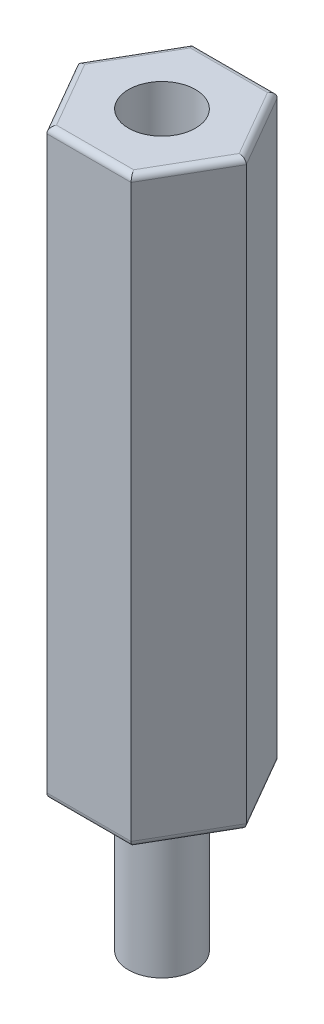
ISO-10303-21;
HEADER;
FILE_DESCRIPTION(('STEP AP214'),'2;1');
FILE_NAME('part.step','',(''),(''),'','','');
FILE_SCHEMA(('AUTOMOTIVE_DESIGN { 1 0 10303 214 1 1 1 1 }'));
ENDSEC;
DATA;
#1=APPLICATION_CONTEXT('core data for automotive mechanical design processes');
#2=APPLICATION_PROTOCOL_DEFINITION('international standard','automotive_design',2000,#1);
#3=PRODUCT_CONTEXT('',#1,'mechanical');
#4=PRODUCT('Part','Part','',(#3));
#5=PRODUCT_RELATED_PRODUCT_CATEGORY('part','',(#4));
#6=PRODUCT_DEFINITION_FORMATION('','',#4);
#7=PRODUCT_DEFINITION_CONTEXT('part definition',#1,'design');
#8=PRODUCT_DEFINITION('design','',#6,#7);
#9=PRODUCT_DEFINITION_SHAPE('','',#8);
#10=(LENGTH_UNIT() NAMED_UNIT(*) SI_UNIT(.MILLI.,.METRE.));
#11=(NAMED_UNIT(*) PLANE_ANGLE_UNIT() SI_UNIT($,.RADIAN.));
#12=(NAMED_UNIT(*) SI_UNIT($,.STERADIAN.) SOLID_ANGLE_UNIT());
#13=UNCERTAINTY_MEASURE_WITH_UNIT(LENGTH_MEASURE(1.E-05),#10,'distance_accuracy_value','');
#14=(GEOMETRIC_REPRESENTATION_CONTEXT(3) GLOBAL_UNCERTAINTY_ASSIGNED_CONTEXT((#13)) GLOBAL_UNIT_ASSIGNED_CONTEXT((#10,
#11,#12)) REPRESENTATION_CONTEXT('',''));
#15=CARTESIAN_POINT('',(0.,0.,0.));
#16=DIRECTION('',(0.,0.,1.));
#17=DIRECTION('',(1.,0.,0.));
#18=AXIS2_PLACEMENT_3D('',#15,#16,#17);
#19=CARTESIAN_POINT('',(2.74818728134262,0.,0.));
#20=DIRECTION('',(0.,1.,0.));
#21=DIRECTION('',(0.,0.,1.));
#22=AXIS2_PLACEMENT_3D('',#19,#20,#21);
#23=PLANE('',#22);
#24=DIRECTION('',(0.5,0.,-0.866025403784439));
#25=VECTOR('',#24,1.);
#26=CARTESIAN_POINT('',(2.57498220058573,0.,-0.1));
#27=LINE('',#26,#25);
#28=CARTESIAN_POINT('',(2.51724717366677,0.,0.));
#29=VERTEX_POINT('',#28);
#30=CARTESIAN_POINT('',(1.25862358683338,0.,2.18));
#31=VERTEX_POINT('',#30);
#32=EDGE_CURVE('E185',#29,#31,#27,.F.);
#33=ORIENTED_EDGE('',*,*,#32,.T.);
#34=DIRECTION('',(1.,0.,0.));
#35=VECTOR('',#34,1.);
#36=CARTESIAN_POINT('',(2.74818728134262,0.,2.18));
#37=LINE('',#36,#35);
#38=CARTESIAN_POINT('',(-1.25862358683339,0.,2.18));
#39=VERTEX_POINT('',#38);
#40=EDGE_CURVE('E38',#31,#39,#37,.F.);
#41=ORIENTED_EDGE('',*,*,#40,.T.);
#42=DIRECTION('',(0.5,0.,0.866025403784439));
#43=VECTOR('',#42,1.);
#44=CARTESIAN_POINT('',(-1.20088855991442,0.,2.28));
#45=LINE('',#44,#43);
#46=CARTESIAN_POINT('',(-2.51724717366677,0.,0.));
#47=VERTEX_POINT('',#46);
#48=EDGE_CURVE('E52',#39,#47,#45,.F.);
#49=ORIENTED_EDGE('',*,*,#48,.T.);
#50=DIRECTION('',(-0.5,0.,0.866025403784439));
#51=VECTOR('',#50,1.);
#52=CARTESIAN_POINT('',(-1.20088855991442,0.,-2.28));
#53=LINE('',#52,#51);
#54=CARTESIAN_POINT('',(-1.25862358683338,0.,-2.18));
#55=VERTEX_POINT('',#54);
#56=EDGE_CURVE('E191',#47,#55,#53,.F.);
#57=ORIENTED_EDGE('',*,*,#56,.T.);
#58=DIRECTION('',(-1.,0.,0.));
#59=VECTOR('',#58,1.);
#60=CARTESIAN_POINT('',(2.74818728134262,0.,-2.18));
#61=LINE('',#60,#59);
#62=CARTESIAN_POINT('',(1.25862358683338,0.,-2.18));
#63=VERTEX_POINT('',#62);
#64=EDGE_CURVE('E189',#55,#63,#61,.F.);
#65=ORIENTED_EDGE('',*,*,#64,.T.);
#66=DIRECTION('',(-0.5,0.,-0.866025403784439));
#67=VECTOR('',#66,1.);
#68=CARTESIAN_POINT('',(2.57498220058573,0.,0.1));
#69=LINE('',#68,#67);
#70=EDGE_CURVE('E187',#63,#29,#69,.F.);
#71=ORIENTED_EDGE('',*,*,#70,.T.);
#72=EDGE_LOOP('',(#33,#41,#49,#57,#65,#71));
#73=FACE_BOUND('',#72,.T.);
#74=CARTESIAN_POINT('',(0.,0.,0.));
#75=DIRECTION('',(0.,1.,0.));
#76=DIRECTION('',(0.,0.,1.));
#77=AXIS2_PLACEMENT_3D('',#74,#75,#76);
#78=CIRCLE('',#77,1.0922);
#79=CARTESIAN_POINT('',(0.,0.,1.0922));
#80=VERTEX_POINT('',#79);
#81=EDGE_CURVE('E11',#80,#80,#78,.F.);
#82=ORIENTED_EDGE('',*,*,#81,.F.);
#83=EDGE_LOOP('',(#82));
#84=FACE_BOUND('',#83,.T.);
#85=ADVANCED_FACE('F30',(#73,#84),#23,.F.);
#86=CARTESIAN_POINT('',(1.37409364067131,19.,2.38));
#87=DIRECTION('',(-0.866025403784439,0.,-0.5));
#88=DIRECTION('',(-0.5,0.,0.866025403784439));
#89=AXIS2_PLACEMENT_3D('',#86,#87,#88);
#90=PLANE('',#89);
#91=DIRECTION('',(0.,-1.,0.));
#92=VECTOR('',#91,1.);
#93=CARTESIAN_POINT('',(2.74818728134262,19.,0.));
#94=LINE('',#93,#92);
#95=CARTESIAN_POINT('',(2.74818728134262,18.8,0.));
#96=VERTEX_POINT('',#95);
#97=CARTESIAN_POINT('',(2.74818728134262,0.200000000000002,0.));
#98=VERTEX_POINT('',#97);
#99=EDGE_CURVE('E146',#96,#98,#94,.T.);
#100=ORIENTED_EDGE('',*,*,#99,.F.);
#101=DIRECTION('',(0.5,0.,-0.866025403784439));
#102=VECTOR('',#101,1.);
#103=CARTESIAN_POINT('',(1.37409364067131,18.8,2.38));
#104=LINE('',#103,#102);
#105=CARTESIAN_POINT('',(1.37409364067131,18.8,2.38));
#106=VERTEX_POINT('',#105);
#107=EDGE_CURVE('E137',#96,#106,#104,.F.);
#108=ORIENTED_EDGE('',*,*,#107,.T.);
#109=DIRECTION('',(0.,-1.,0.));
#110=VECTOR('',#109,1.);
#111=CARTESIAN_POINT('',(1.37409364067131,19.,2.38));
#112=LINE('',#111,#110);
#113=CARTESIAN_POINT('',(1.37409364067131,0.200000000000002,2.38));
#114=VERTEX_POINT('',#113);
#115=EDGE_CURVE('E205',#106,#114,#112,.T.);
#116=ORIENTED_EDGE('',*,*,#115,.T.);
#117=DIRECTION('',(0.5,0.,-0.866025403784439));
#118=VECTOR('',#117,1.);
#119=CARTESIAN_POINT('',(1.37409364067131,0.199999999999999,2.38));
#120=LINE('',#119,#118);
#121=EDGE_CURVE('E178',#114,#98,#120,.T.);
#122=ORIENTED_EDGE('',*,*,#121,.T.);
#123=EDGE_LOOP('',(#100,#108,#116,#122));
#124=FACE_BOUND('',#123,.T.);
#125=ADVANCED_FACE('F250',(#124),#90,.F.);
#126=CARTESIAN_POINT('',(2.74818728134262,19.,0.));
#127=DIRECTION('',(-0.866025403784439,0.,0.5));
#128=DIRECTION('',(0.5,0.,0.866025403784439));
#129=AXIS2_PLACEMENT_3D('',#126,#127,#128);
#130=PLANE('',#129);
#131=DIRECTION('',(0.,-1.,0.));
#132=VECTOR('',#131,1.);
#133=CARTESIAN_POINT('',(1.37409364067131,19.,-2.38));
#134=LINE('',#133,#132);
#135=CARTESIAN_POINT('',(1.37409364067131,18.8,-2.38));
#136=VERTEX_POINT('',#135);
#137=CARTESIAN_POINT('',(1.37409364067131,0.200000000000002,-2.38));
#138=VERTEX_POINT('',#137);
#139=EDGE_CURVE('E149',#136,#138,#134,.T.);
#140=ORIENTED_EDGE('',*,*,#139,.F.);
#141=DIRECTION('',(-0.5,0.,-0.866025403784439));
#142=VECTOR('',#141,1.);
#143=CARTESIAN_POINT('',(2.74818728134262,18.8,0.));
#144=LINE('',#143,#142);
#145=EDGE_CURVE('E183',#136,#96,#144,.F.);
#146=ORIENTED_EDGE('',*,*,#145,.T.);
#147=ORIENTED_EDGE('',*,*,#99,.T.);
#148=DIRECTION('',(-0.5,0.,-0.866025403784439));
#149=VECTOR('',#148,1.);
#150=CARTESIAN_POINT('',(2.74818728134262,0.199999999999999,0.));
#151=LINE('',#150,#149);
#152=EDGE_CURVE('E181',#98,#138,#151,.T.);
#153=ORIENTED_EDGE('',*,*,#152,.T.);
#154=EDGE_LOOP('',(#140,#146,#147,#153));
#155=FACE_BOUND('',#154,.T.);
#156=ADVANCED_FACE('F268',(#155),#130,.F.);
#157=CARTESIAN_POINT('',(1.37409364067131,19.,-2.38));
#158=DIRECTION('',(0.,0.,1.));
#159=DIRECTION('',(1.,0.,0.));
#160=AXIS2_PLACEMENT_3D('',#157,#158,#159);
#161=PLANE('',#160);
#162=DIRECTION('',(0.,-1.,0.));
#163=VECTOR('',#162,1.);
#164=CARTESIAN_POINT('',(-1.37409364067131,19.,-2.38));
#165=LINE('',#164,#163);
#166=CARTESIAN_POINT('',(-1.37409364067131,18.8,-2.38));
#167=VERTEX_POINT('',#166);
#168=CARTESIAN_POINT('',(-1.37409364067131,0.200000000000002,-2.38));
#169=VERTEX_POINT('',#168);
#170=EDGE_CURVE('E259',#167,#169,#165,.T.);
#171=ORIENTED_EDGE('',*,*,#170,.F.);
#172=DIRECTION('',(-1.,0.,0.));
#173=VECTOR('',#172,1.);
#174=CARTESIAN_POINT('',(1.37409364067131,18.8,-2.38));
#175=LINE('',#174,#173);
#176=EDGE_CURVE('E162',#167,#136,#175,.F.);
#177=ORIENTED_EDGE('',*,*,#176,.T.);
#178=ORIENTED_EDGE('',*,*,#139,.T.);
#179=DIRECTION('',(-1.,0.,0.));
#180=VECTOR('',#179,1.);
#181=CARTESIAN_POINT('',(1.37409364067131,0.199999999999999,-2.38));
#182=LINE('',#181,#180);
#183=EDGE_CURVE('E160',#138,#169,#182,.T.);
#184=ORIENTED_EDGE('',*,*,#183,.T.);
#185=EDGE_LOOP('',(#171,#177,#178,#184));
#186=FACE_BOUND('',#185,.T.);
#187=ADVANCED_FACE('F265',(#186),#161,.F.);
#188=CARTESIAN_POINT('',(-1.37409364067131,19.,-2.38));
#189=DIRECTION('',(0.866025403784439,0.,0.5));
#190=DIRECTION('',(0.5,0.,-0.866025403784439));
#191=AXIS2_PLACEMENT_3D('',#188,#189,#190);
#192=PLANE('',#191);
#193=DIRECTION('',(0.,-1.,0.));
#194=VECTOR('',#193,1.);
#195=CARTESIAN_POINT('',(-2.74818728134262,19.,0.));
#196=LINE('',#195,#194);
#197=CARTESIAN_POINT('',(-2.74818728134262,18.8,0.));
#198=VERTEX_POINT('',#197);
#199=CARTESIAN_POINT('',(-2.74818728134262,0.200000000000002,0.));
#200=VERTEX_POINT('',#199);
#201=EDGE_CURVE('E252',#198,#200,#196,.T.);
#202=ORIENTED_EDGE('',*,*,#201,.F.);
#203=DIRECTION('',(-0.5,0.,0.866025403784439));
#204=VECTOR('',#203,1.);
#205=CARTESIAN_POINT('',(-1.37409364067131,18.8,-2.38));
#206=LINE('',#205,#204);
#207=EDGE_CURVE('E167',#198,#167,#206,.F.);
#208=ORIENTED_EDGE('',*,*,#207,.T.);
#209=ORIENTED_EDGE('',*,*,#170,.T.);
#210=DIRECTION('',(-0.5,0.,0.866025403784439));
#211=VECTOR('',#210,1.);
#212=CARTESIAN_POINT('',(-1.37409364067131,0.199999999999999,-2.38));
#213=LINE('',#212,#211);
#214=EDGE_CURVE('E165',#169,#200,#213,.T.);
#215=ORIENTED_EDGE('',*,*,#214,.T.);
#216=EDGE_LOOP('',(#202,#208,#209,#215));
#217=FACE_BOUND('',#216,.T.);
#218=ADVANCED_FACE('F275',(#217),#192,.F.);
#219=CARTESIAN_POINT('',(-2.74818728134262,19.,0.));
#220=DIRECTION('',(0.866025403784439,0.,-0.5));
#221=DIRECTION('',(-0.5,0.,-0.866025403784439));
#222=AXIS2_PLACEMENT_3D('',#219,#220,#221);
#223=PLANE('',#222);
#224=DIRECTION('',(0.,-1.,0.));
#225=VECTOR('',#224,1.);
#226=CARTESIAN_POINT('',(-1.37409364067131,19.,2.38));
#227=LINE('',#226,#225);
#228=CARTESIAN_POINT('',(-1.37409364067131,18.8,2.38));
#229=VERTEX_POINT('',#228);
#230=CARTESIAN_POINT('',(-1.37409364067131,0.200000000000002,2.38));
#231=VERTEX_POINT('',#230);
#232=EDGE_CURVE('E247',#229,#231,#227,.T.);
#233=ORIENTED_EDGE('',*,*,#232,.F.);
#234=DIRECTION('',(0.5,0.,0.866025403784439));
#235=VECTOR('',#234,1.);
#236=CARTESIAN_POINT('',(-2.74818728134262,18.8,0.));
#237=LINE('',#236,#235);
#238=EDGE_CURVE('E171',#229,#198,#237,.F.);
#239=ORIENTED_EDGE('',*,*,#238,.T.);
#240=ORIENTED_EDGE('',*,*,#201,.T.);
#241=DIRECTION('',(0.5,0.,0.866025403784439));
#242=VECTOR('',#241,1.);
#243=CARTESIAN_POINT('',(-2.74818728134262,0.199999999999999,0.));
#244=LINE('',#243,#242);
#245=EDGE_CURVE('E169',#200,#231,#244,.T.);
#246=ORIENTED_EDGE('',*,*,#245,.T.);
#247=EDGE_LOOP('',(#233,#239,#240,#246));
#248=FACE_BOUND('',#247,.T.);
#249=ADVANCED_FACE('F287',(#248),#223,.F.);
#250=CARTESIAN_POINT('',(-1.37409364067131,19.,2.38));
#251=DIRECTION('',(0.,0.,-1.));
#252=DIRECTION('',(-1.,0.,0.));
#253=AXIS2_PLACEMENT_3D('',#250,#251,#252);
#254=PLANE('',#253);
#255=ORIENTED_EDGE('',*,*,#115,.F.);
#256=DIRECTION('',(1.,0.,0.));
#257=VECTOR('',#256,1.);
#258=CARTESIAN_POINT('',(-1.37409364067131,18.8,2.38));
#259=LINE('',#258,#257);
#260=EDGE_CURVE('E176',#106,#229,#259,.F.);
#261=ORIENTED_EDGE('',*,*,#260,.T.);
#262=ORIENTED_EDGE('',*,*,#232,.T.);
#263=DIRECTION('',(1.,0.,0.));
#264=VECTOR('',#263,1.);
#265=CARTESIAN_POINT('',(-1.37409364067131,0.199999999999999,2.38));
#266=LINE('',#265,#264);
#267=EDGE_CURVE('E173',#231,#114,#266,.T.);
#268=ORIENTED_EDGE('',*,*,#267,.T.);
#269=EDGE_LOOP('',(#255,#261,#262,#268));
#270=FACE_BOUND('',#269,.T.);
#271=ADVANCED_FACE('F244',(#270),#254,.F.);
#272=CARTESIAN_POINT('',(2.74818728134262,19.,0.));
#273=DIRECTION('',(0.,1.,0.));
#274=DIRECTION('',(0.,0.,1.));
#275=AXIS2_PLACEMENT_3D('',#272,#273,#274);
#276=PLANE('',#275);
#277=CARTESIAN_POINT('',(0.,19.,0.));
#278=DIRECTION('',(0.,1.,0.));
#279=DIRECTION('',(0.,0.,1.));
#280=AXIS2_PLACEMENT_3D('',#277,#278,#279);
#281=CIRCLE('',#280,1.0922);
#282=CARTESIAN_POINT('',(0.,19.,1.0922));
#283=VERTEX_POINT('',#282);
#284=EDGE_CURVE('E370',#283,#283,#281,.T.);
#285=ORIENTED_EDGE('',*,*,#284,.F.);
#286=EDGE_LOOP('',(#285));
#287=FACE_BOUND('',#286,.T.);
#288=DIRECTION('',(-0.5,0.,-0.866025403784439));
#289=VECTOR('',#288,1.);
#290=CARTESIAN_POINT('',(1.20088855991442,19.,-2.28));
#291=LINE('',#290,#289);
#292=CARTESIAN_POINT('',(2.51724717366677,19.,0.));
#293=VERTEX_POINT('',#292);
#294=CARTESIAN_POINT('',(1.25862358683338,19.,-2.18));
#295=VERTEX_POINT('',#294);
#296=EDGE_CURVE('E125',#293,#295,#291,.T.);
#297=ORIENTED_EDGE('',*,*,#296,.T.);
#298=DIRECTION('',(-1.,0.,0.));
#299=VECTOR('',#298,1.);
#300=CARTESIAN_POINT('',(-1.37409364067131,19.,-2.18));
#301=LINE('',#300,#299);
#302=CARTESIAN_POINT('',(-1.25862358683338,19.,-2.18));
#303=VERTEX_POINT('',#302);
#304=EDGE_CURVE('E158',#295,#303,#301,.T.);
#305=ORIENTED_EDGE('',*,*,#304,.T.);
#306=DIRECTION('',(-0.5,0.,0.866025403784439));
#307=VECTOR('',#306,1.);
#308=CARTESIAN_POINT('',(-2.57498220058573,19.,0.100000000000001));
#309=LINE('',#308,#307);
#310=CARTESIAN_POINT('',(-2.51724717366677,19.,0.));
#311=VERTEX_POINT('',#310);
#312=EDGE_CURVE('E156',#303,#311,#309,.T.);
#313=ORIENTED_EDGE('',*,*,#312,.T.);
#314=DIRECTION('',(0.5,0.,0.866025403784439));
#315=VECTOR('',#314,1.);
#316=CARTESIAN_POINT('',(-1.20088855991442,19.,2.28));
#317=LINE('',#316,#315);
#318=CARTESIAN_POINT('',(-1.25862358683339,19.,2.18));
#319=VERTEX_POINT('',#318);
#320=EDGE_CURVE('E154',#311,#319,#317,.T.);
#321=ORIENTED_EDGE('',*,*,#320,.T.);
#322=DIRECTION('',(1.,0.,0.));
#323=VECTOR('',#322,1.);
#324=CARTESIAN_POINT('',(1.37409364067131,19.,2.18));
#325=LINE('',#324,#323);
#326=CARTESIAN_POINT('',(1.25862358683338,19.,2.18));
#327=VERTEX_POINT('',#326);
#328=EDGE_CURVE('E128',#319,#327,#325,.T.);
#329=ORIENTED_EDGE('',*,*,#328,.T.);
#330=DIRECTION('',(0.5,0.,-0.866025403784439));
#331=VECTOR('',#330,1.);
#332=CARTESIAN_POINT('',(2.57498220058573,19.,-0.1));
#333=LINE('',#332,#331);
#334=EDGE_CURVE('E120',#327,#293,#333,.T.);
#335=ORIENTED_EDGE('',*,*,#334,.T.);
#336=EDGE_LOOP('',(#297,#305,#313,#321,#329,#335));
#337=FACE_BOUND('',#336,.T.);
#338=ADVANCED_FACE('F122',(#287,#337),#276,.T.);
#339=CARTESIAN_POINT('',(2.74818728134262,18.8,2.18));
#340=DIRECTION('',(-1.,0.,0.));
#341=DIRECTION('',(0.,0.,1.));
#342=AXIS2_PLACEMENT_3D('',#339,#340,#341);
#343=CYLINDRICAL_SURFACE('',#342,0.2);
#344=CARTESIAN_POINT('',(-1.25862358683339,18.8,2.18));
#345=DIRECTION('',(-0.866025403784439,0.,-0.5));
#346=DIRECTION('',(-0.5,0.,0.866025403784439));
#347=AXIS2_PLACEMENT_3D('',#344,#345,#346);
#348=ELLIPSE('',#347,0.23094010767585,0.2);
#349=EDGE_CURVE('E140',#229,#319,#348,.T.);
#350=ORIENTED_EDGE('',*,*,#349,.F.);
#351=ORIENTED_EDGE('',*,*,#260,.F.);
#352=CARTESIAN_POINT('',(1.25862358683338,18.8,2.18));
#353=DIRECTION('',(-0.866025403784438,0.,0.5));
#354=DIRECTION('',(0.5,0.,0.866025403784439));
#355=AXIS2_PLACEMENT_3D('',#352,#353,#354);
#356=ELLIPSE('',#355,0.23094010767585,0.2);
#357=EDGE_CURVE('E203',#327,#106,#356,.F.);
#358=ORIENTED_EDGE('',*,*,#357,.F.);
#359=ORIENTED_EDGE('',*,*,#328,.F.);
#360=EDGE_LOOP('',(#350,#351,#358,#359));
#361=FACE_BOUND('',#360,.T.);
#362=ADVANCED_FACE('F310',(#361),#343,.T.);
#363=CARTESIAN_POINT('',(2.57498220058573,18.8,-0.1));
#364=DIRECTION('',(-0.5,0.,0.866025403784439));
#365=DIRECTION('',(0.866025403784439,0.,0.5));
#366=AXIS2_PLACEMENT_3D('',#363,#364,#365);
#367=CYLINDRICAL_SURFACE('',#366,0.2);
#368=ORIENTED_EDGE('',*,*,#357,.T.);
#369=ORIENTED_EDGE('',*,*,#107,.F.);
#370=CARTESIAN_POINT('',(2.51724717366677,18.8,0.));
#371=DIRECTION('',(0.,0.,1.));
#372=DIRECTION('',(1.,0.,0.));
#373=AXIS2_PLACEMENT_3D('',#370,#371,#372);
#374=ELLIPSE('',#373,0.23094010767585,0.2);
#375=EDGE_CURVE('E135',#293,#96,#374,.F.);
#376=ORIENTED_EDGE('',*,*,#375,.F.);
#377=ORIENTED_EDGE('',*,*,#334,.F.);
#378=EDGE_LOOP('',(#368,#369,#376,#377));
#379=FACE_BOUND('',#378,.T.);
#380=ADVANCED_FACE('F136',(#379),#367,.T.);
#381=CARTESIAN_POINT('',(-1.20088855991442,18.8,2.28));
#382=DIRECTION('',(-0.5,0.,-0.866025403784439));
#383=DIRECTION('',(-0.866025403784439,0.,0.5));
#384=AXIS2_PLACEMENT_3D('',#381,#382,#383);
#385=CYLINDRICAL_SURFACE('',#384,0.2);
#386=ORIENTED_EDGE('',*,*,#349,.T.);
#387=ORIENTED_EDGE('',*,*,#320,.F.);
#388=CARTESIAN_POINT('',(-2.51724717366677,18.8,0.));
#389=DIRECTION('',(0.,0.,-1.));
#390=DIRECTION('',(-1.,0.,0.));
#391=AXIS2_PLACEMENT_3D('',#388,#389,#390);
#392=ELLIPSE('',#391,0.23094010767585,0.2);
#393=EDGE_CURVE('E141',#198,#311,#392,.T.);
#394=ORIENTED_EDGE('',*,*,#393,.F.);
#395=ORIENTED_EDGE('',*,*,#238,.F.);
#396=EDGE_LOOP('',(#386,#387,#394,#395));
#397=FACE_BOUND('',#396,.T.);
#398=ADVANCED_FACE('F301',(#397),#385,.T.);
#399=CARTESIAN_POINT('',(2.57498220058573,18.8,0.1));
#400=DIRECTION('',(0.5,0.,0.866025403784439));
#401=DIRECTION('',(0.866025403784439,0.,-0.5));
#402=AXIS2_PLACEMENT_3D('',#399,#400,#401);
#403=CYLINDRICAL_SURFACE('',#402,0.2);
#404=ORIENTED_EDGE('',*,*,#375,.T.);
#405=ORIENTED_EDGE('',*,*,#145,.F.);
#406=CARTESIAN_POINT('',(1.25862358683338,18.8,-2.18));
#407=DIRECTION('',(0.866025403784439,0.,0.5));
#408=DIRECTION('',(-0.5,0.,0.866025403784439));
#409=AXIS2_PLACEMENT_3D('',#406,#407,#408);
#410=ELLIPSE('',#409,0.23094010767585,0.2);
#411=EDGE_CURVE('E144',#295,#136,#410,.F.);
#412=ORIENTED_EDGE('',*,*,#411,.F.);
#413=ORIENTED_EDGE('',*,*,#296,.F.);
#414=EDGE_LOOP('',(#404,#405,#412,#413));
#415=FACE_BOUND('',#414,.T.);
#416=ADVANCED_FACE('F143',(#415),#403,.T.);
#417=CARTESIAN_POINT('',(-1.20088855991442,18.8,-2.28));
#418=DIRECTION('',(0.5,0.,-0.866025403784439));
#419=DIRECTION('',(-0.866025403784439,0.,-0.5));
#420=AXIS2_PLACEMENT_3D('',#417,#418,#419);
#421=CYLINDRICAL_SURFACE('',#420,0.2);
#422=ORIENTED_EDGE('',*,*,#393,.T.);
#423=ORIENTED_EDGE('',*,*,#312,.F.);
#424=CARTESIAN_POINT('',(-1.25862358683338,18.8,-2.18));
#425=DIRECTION('',(0.866025403784439,0.,-0.5));
#426=DIRECTION('',(-0.5,0.,-0.866025403784438));
#427=AXIS2_PLACEMENT_3D('',#424,#425,#426);
#428=ELLIPSE('',#427,0.23094010767585,0.2);
#429=EDGE_CURVE('E195',#167,#303,#428,.T.);
#430=ORIENTED_EDGE('',*,*,#429,.F.);
#431=ORIENTED_EDGE('',*,*,#207,.F.);
#432=EDGE_LOOP('',(#422,#423,#430,#431));
#433=FACE_BOUND('',#432,.T.);
#434=ADVANCED_FACE('F305',(#433),#421,.T.);
#435=CARTESIAN_POINT('',(2.74818728134262,18.8,-2.18));
#436=DIRECTION('',(1.,0.,0.));
#437=DIRECTION('',(0.,0.,-1.));
#438=AXIS2_PLACEMENT_3D('',#435,#436,#437);
#439=CYLINDRICAL_SURFACE('',#438,0.2);
#440=ORIENTED_EDGE('',*,*,#411,.T.);
#441=ORIENTED_EDGE('',*,*,#176,.F.);
#442=ORIENTED_EDGE('',*,*,#429,.T.);
#443=ORIENTED_EDGE('',*,*,#304,.F.);
#444=EDGE_LOOP('',(#440,#441,#442,#443));
#445=FACE_BOUND('',#444,.T.);
#446=ADVANCED_FACE('F307',(#445),#439,.T.);
#447=CARTESIAN_POINT('',(1.37409364067131,0.199999999999999,-2.18));
#448=DIRECTION('',(-1.,0.,0.));
#449=DIRECTION('',(0.,0.,1.));
#450=AXIS2_PLACEMENT_3D('',#447,#448,#449);
#451=CYLINDRICAL_SURFACE('',#450,0.2);
#452=CARTESIAN_POINT('',(1.25862358683338,0.199999999999999,-2.18));
#453=DIRECTION('',(-0.866025403784439,0.,-0.5));
#454=DIRECTION('',(0.5,0.,-0.866025403784439));
#455=AXIS2_PLACEMENT_3D('',#452,#453,#454);
#456=ELLIPSE('',#455,0.23094010767585,0.2);
#457=EDGE_CURVE('E216',#63,#138,#456,.F.);
#458=ORIENTED_EDGE('',*,*,#457,.F.);
#459=ORIENTED_EDGE('',*,*,#64,.F.);
#460=CARTESIAN_POINT('',(-1.25862358683338,0.199999999999999,-2.18));
#461=DIRECTION('',(-0.866025403784439,0.,0.5));
#462=DIRECTION('',(-0.5,0.,-0.866025403784438));
#463=AXIS2_PLACEMENT_3D('',#460,#461,#462);
#464=ELLIPSE('',#463,0.23094010767585,0.2);
#465=EDGE_CURVE('E197',#169,#55,#464,.T.);
#466=ORIENTED_EDGE('',*,*,#465,.F.);
#467=ORIENTED_EDGE('',*,*,#183,.F.);
#468=EDGE_LOOP('',(#458,#459,#466,#467));
#469=FACE_BOUND('',#468,.T.);
#470=ADVANCED_FACE('F32',(#469),#451,.T.);
#471=CARTESIAN_POINT('',(-1.20088855991442,0.199999999999999,-2.28));
#472=DIRECTION('',(-0.5,0.,0.866025403784439));
#473=DIRECTION('',(0.866025403784439,0.,0.5));
#474=AXIS2_PLACEMENT_3D('',#471,#472,#473);
#475=CYLINDRICAL_SURFACE('',#474,0.2);
#476=ORIENTED_EDGE('',*,*,#465,.T.);
#477=ORIENTED_EDGE('',*,*,#56,.F.);
#478=CARTESIAN_POINT('',(-2.51724717366677,0.199999999999999,0.));
#479=DIRECTION('',(0.,0.,1.));
#480=DIRECTION('',(-1.,0.,0.));
#481=AXIS2_PLACEMENT_3D('',#478,#479,#480);
#482=ELLIPSE('',#481,0.23094010767585,0.2);
#483=EDGE_CURVE('E213',#200,#47,#482,.T.);
#484=ORIENTED_EDGE('',*,*,#483,.F.);
#485=ORIENTED_EDGE('',*,*,#214,.F.);
#486=EDGE_LOOP('',(#476,#477,#484,#485));
#487=FACE_BOUND('',#486,.T.);
#488=ADVANCED_FACE('F222',(#487),#475,.T.);
#489=CARTESIAN_POINT('',(2.57498220058573,0.199999999999999,0.1));
#490=DIRECTION('',(-0.5,0.,-0.866025403784439));
#491=DIRECTION('',(-0.866025403784439,0.,0.5));
#492=AXIS2_PLACEMENT_3D('',#489,#490,#491);
#493=CYLINDRICAL_SURFACE('',#492,0.2);
#494=ORIENTED_EDGE('',*,*,#457,.T.);
#495=ORIENTED_EDGE('',*,*,#152,.F.);
#496=CARTESIAN_POINT('',(2.51724717366677,0.199999999999999,0.));
#497=DIRECTION('',(0.,0.,-1.));
#498=DIRECTION('',(1.,0.,0.));
#499=AXIS2_PLACEMENT_3D('',#496,#497,#498);
#500=ELLIPSE('',#499,0.23094010767585,0.2);
#501=EDGE_CURVE('E210',#29,#98,#500,.F.);
#502=ORIENTED_EDGE('',*,*,#501,.F.);
#503=ORIENTED_EDGE('',*,*,#70,.F.);
#504=EDGE_LOOP('',(#494,#495,#502,#503));
#505=FACE_BOUND('',#504,.T.);
#506=ADVANCED_FACE('F234',(#505),#493,.T.);
#507=CARTESIAN_POINT('',(-2.57498220058573,0.199999999999999,-0.0999999999999992));
#508=DIRECTION('',(0.5,0.,0.866025403784439));
#509=DIRECTION('',(0.866025403784439,0.,-0.5));
#510=AXIS2_PLACEMENT_3D('',#507,#508,#509);
#511=CYLINDRICAL_SURFACE('',#510,0.2);
#512=ORIENTED_EDGE('',*,*,#483,.T.);
#513=ORIENTED_EDGE('',*,*,#48,.F.);
#514=CARTESIAN_POINT('',(-1.25862358683339,0.199999999999999,2.18));
#515=DIRECTION('',(0.866025403784439,0.,0.5));
#516=DIRECTION('',(-0.5,0.,0.866025403784439));
#517=AXIS2_PLACEMENT_3D('',#514,#515,#516);
#518=ELLIPSE('',#517,0.23094010767585,0.2);
#519=EDGE_CURVE('E45',#231,#39,#518,.T.);
#520=ORIENTED_EDGE('',*,*,#519,.F.);
#521=ORIENTED_EDGE('',*,*,#245,.F.);
#522=EDGE_LOOP('',(#512,#513,#520,#521));
#523=FACE_BOUND('',#522,.T.);
#524=ADVANCED_FACE('F313',(#523),#511,.T.);
#525=CARTESIAN_POINT('',(1.20088855991442,0.199999999999999,2.28));
#526=DIRECTION('',(0.5,0.,-0.866025403784439));
#527=DIRECTION('',(-0.866025403784439,0.,-0.5));
#528=AXIS2_PLACEMENT_3D('',#525,#526,#527);
#529=CYLINDRICAL_SURFACE('',#528,0.2);
#530=ORIENTED_EDGE('',*,*,#501,.T.);
#531=ORIENTED_EDGE('',*,*,#121,.F.);
#532=CARTESIAN_POINT('',(1.25862358683338,0.199999999999999,2.18));
#533=DIRECTION('',(0.866025403784438,0.,-0.5));
#534=DIRECTION('',(-0.5,0.,-0.866025403784439));
#535=AXIS2_PLACEMENT_3D('',#532,#533,#534);
#536=ELLIPSE('',#535,0.23094010767585,0.2);
#537=EDGE_CURVE('E206',#31,#114,#536,.F.);
#538=ORIENTED_EDGE('',*,*,#537,.F.);
#539=ORIENTED_EDGE('',*,*,#32,.F.);
#540=EDGE_LOOP('',(#530,#531,#538,#539));
#541=FACE_BOUND('',#540,.T.);
#542=ADVANCED_FACE('F238',(#541),#529,.T.);
#543=CARTESIAN_POINT('',(-1.37409364067131,0.199999999999999,2.18));
#544=DIRECTION('',(1.,0.,0.));
#545=DIRECTION('',(0.,0.,-1.));
#546=AXIS2_PLACEMENT_3D('',#543,#544,#545);
#547=CYLINDRICAL_SURFACE('',#546,0.2);
#548=ORIENTED_EDGE('',*,*,#519,.T.);
#549=ORIENTED_EDGE('',*,*,#40,.F.);
#550=ORIENTED_EDGE('',*,*,#537,.T.);
#551=ORIENTED_EDGE('',*,*,#267,.F.);
#552=EDGE_LOOP('',(#548,#549,#550,#551));
#553=FACE_BOUND('',#552,.T.);
#554=ADVANCED_FACE('F239',(#553),#547,.T.);
#555=CARTESIAN_POINT('',(0.,-4.76,0.));
#556=DIRECTION('',(0.,1.,0.));
#557=DIRECTION('',(0.,0.,1.));
#558=AXIS2_PLACEMENT_3D('',#555,#556,#557);
#559=CYLINDRICAL_SURFACE('',#558,1.0922);
#560=CARTESIAN_POINT('',(0.,-4.76,0.));
#561=DIRECTION('',(0.,-1.,0.));
#562=DIRECTION('',(0.,0.,-1.));
#563=AXIS2_PLACEMENT_3D('',#560,#561,#562);
#564=CIRCLE('',#563,1.0922);
#565=CARTESIAN_POINT('',(0.,-4.76,-1.0922));
#566=VERTEX_POINT('',#565);
#567=EDGE_CURVE('E208',#566,#566,#564,.T.);
#568=ORIENTED_EDGE('',*,*,#567,.F.);
#569=EDGE_LOOP('',(#568));
#570=FACE_BOUND('',#569,.T.);
#571=ORIENTED_EDGE('',*,*,#81,.T.);
#572=EDGE_LOOP('',(#571));
#573=FACE_BOUND('',#572,.T.);
#574=ADVANCED_FACE('F344',(#570,#573),#559,.T.);
#575=CARTESIAN_POINT('',(0.,-4.76,0.));
#576=DIRECTION('',(0.,-1.,0.));
#577=DIRECTION('',(0.,0.,-1.));
#578=AXIS2_PLACEMENT_3D('',#575,#576,#577);
#579=PLANE('',#578);
#580=ORIENTED_EDGE('',*,*,#567,.T.);
#581=EDGE_LOOP('',(#580));
#582=FACE_BOUND('',#581,.T.);
#583=ADVANCED_FACE('F348',(#582),#579,.T.);
#584=CARTESIAN_POINT('',(0.,14.24,0.));
#585=DIRECTION('',(0.,1.,0.));
#586=DIRECTION('',(0.,0.,1.));
#587=AXIS2_PLACEMENT_3D('',#584,#585,#586);
#588=CYLINDRICAL_SURFACE('',#587,1.0922);
#589=CARTESIAN_POINT('',(0.,14.24,0.));
#590=DIRECTION('',(0.,1.,0.));
#591=DIRECTION('',(0.,0.,1.));
#592=AXIS2_PLACEMENT_3D('',#589,#590,#591);
#593=CIRCLE('',#592,1.0922);
#594=CARTESIAN_POINT('',(0.,14.24,1.0922));
#595=VERTEX_POINT('',#594);
#596=EDGE_CURVE('E369',#595,#595,#593,.T.);
#597=ORIENTED_EDGE('',*,*,#596,.F.);
#598=EDGE_LOOP('',(#597));
#599=FACE_BOUND('',#598,.T.);
#600=ORIENTED_EDGE('',*,*,#284,.T.);
#601=EDGE_LOOP('',(#600));
#602=FACE_BOUND('',#601,.T.);
#603=ADVANCED_FACE('F353',(#599,#602),#588,.F.);
#604=CARTESIAN_POINT('',(0.,14.24,0.));
#605=DIRECTION('',(0.,1.,0.));
#606=DIRECTION('',(0.,0.,1.));
#607=AXIS2_PLACEMENT_3D('',#604,#605,#606);
#608=PLANE('',#607);
#609=ORIENTED_EDGE('',*,*,#596,.T.);
#610=EDGE_LOOP('',(#609));
#611=FACE_BOUND('',#610,.T.);
#612=ADVANCED_FACE('F361',(#611),#608,.T.);
#613=CLOSED_SHELL('',(#85,#125,#156,#187,#218,#249,#271,#338,#362,#380,#398,#416,#434,#446,#470,
#488,#506,#524,#542,#554,#574,#583,#603,#612));
#614=MANIFOLD_SOLID_BREP('B2',#613);
#615=ADVANCED_BREP_SHAPE_REPRESENTATION('',(#18,#614),#14);
#616=SHAPE_DEFINITION_REPRESENTATION(#9,#615);
ENDSEC;
END-ISO-10303-21;
